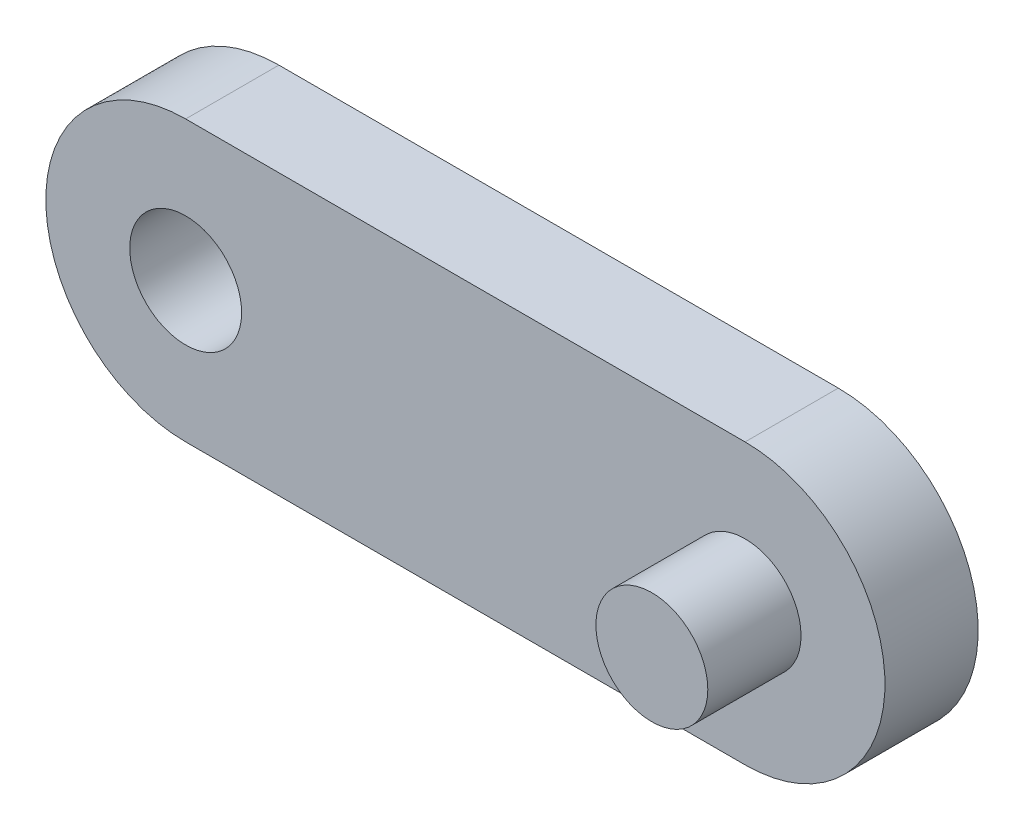
ISO-10303-21;
HEADER;
FILE_DESCRIPTION(('STEP AP214'),'2;1');
FILE_NAME('part.step','',(''),(''),'','','');
FILE_SCHEMA(('AUTOMOTIVE_DESIGN { 1 0 10303 214 1 1 1 1 }'));
ENDSEC;
DATA;
#1=APPLICATION_CONTEXT('core data for automotive mechanical design processes');
#2=APPLICATION_PROTOCOL_DEFINITION('international standard','automotive_design',2000,#1);
#3=PRODUCT_CONTEXT('',#1,'mechanical');
#4=PRODUCT('Part','Part','',(#3));
#5=PRODUCT_RELATED_PRODUCT_CATEGORY('part','',(#4));
#6=PRODUCT_DEFINITION_FORMATION('','',#4);
#7=PRODUCT_DEFINITION_CONTEXT('part definition',#1,'design');
#8=PRODUCT_DEFINITION('design','',#6,#7);
#9=PRODUCT_DEFINITION_SHAPE('','',#8);
#10=(LENGTH_UNIT() NAMED_UNIT(*) SI_UNIT(.MILLI.,.METRE.));
#11=(NAMED_UNIT(*) PLANE_ANGLE_UNIT() SI_UNIT($,.RADIAN.));
#12=(NAMED_UNIT(*) SI_UNIT($,.STERADIAN.) SOLID_ANGLE_UNIT());
#13=UNCERTAINTY_MEASURE_WITH_UNIT(LENGTH_MEASURE(1.E-05),#10,'distance_accuracy_value','');
#14=(GEOMETRIC_REPRESENTATION_CONTEXT(3) GLOBAL_UNCERTAINTY_ASSIGNED_CONTEXT((#13)) GLOBAL_UNIT_ASSIGNED_CONTEXT((#10,
#11,#12)) REPRESENTATION_CONTEXT('',''));
#15=CARTESIAN_POINT('',(0.,0.,0.));
#16=DIRECTION('',(0.,0.,1.));
#17=DIRECTION('',(1.,0.,0.));
#18=AXIS2_PLACEMENT_3D('',#15,#16,#17);
#19=CARTESIAN_POINT('',(0.,0.,10.));
#20=DIRECTION('',(0.,0.,1.));
#21=DIRECTION('',(1.,0.,0.));
#22=AXIS2_PLACEMENT_3D('',#19,#20,#21);
#23=PLANE('',#22);
#24=CARTESIAN_POINT('',(60.,0.,10.));
#25=DIRECTION('',(0.,0.,1.));
#26=DIRECTION('',(1.,0.,0.));
#27=AXIS2_PLACEMENT_3D('',#24,#25,#26);
#28=CIRCLE('',#27,6.00000000000002);
#29=CARTESIAN_POINT('',(66.,0.,10.));
#30=VERTEX_POINT('',#29);
#31=EDGE_CURVE('E118',#30,#30,#28,.T.);
#32=ORIENTED_EDGE('',*,*,#31,.F.);
#33=EDGE_LOOP('',(#32));
#34=FACE_BOUND('',#33,.T.);
#35=CARTESIAN_POINT('',(0.,0.,10.));
#36=DIRECTION('',(0.,0.,1.));
#37=DIRECTION('',(1.,0.,0.));
#38=AXIS2_PLACEMENT_3D('',#35,#36,#37);
#39=CIRCLE('',#38,15.);
#40=CARTESIAN_POINT('',(0.,15.,10.));
#41=VERTEX_POINT('',#40);
#42=CARTESIAN_POINT('',(0.,-15.,10.));
#43=VERTEX_POINT('',#42);
#44=EDGE_CURVE('E85',#41,#43,#39,.T.);
#45=ORIENTED_EDGE('',*,*,#44,.T.);
#46=DIRECTION('',(1.,0.,0.));
#47=VECTOR('',#46,1.);
#48=CARTESIAN_POINT('',(0.,-15.,10.));
#49=LINE('',#48,#47);
#50=CARTESIAN_POINT('',(60.,-15.,10.));
#51=VERTEX_POINT('',#50);
#52=EDGE_CURVE('E80',#43,#51,#49,.T.);
#53=ORIENTED_EDGE('',*,*,#52,.T.);
#54=CARTESIAN_POINT('',(60.,0.,10.));
#55=DIRECTION('',(0.,0.,1.));
#56=DIRECTION('',(1.,0.,0.));
#57=AXIS2_PLACEMENT_3D('',#54,#55,#56);
#58=CIRCLE('',#57,15.);
#59=CARTESIAN_POINT('',(60.,15.,10.));
#60=VERTEX_POINT('',#59);
#61=EDGE_CURVE('E83',#51,#60,#58,.T.);
#62=ORIENTED_EDGE('',*,*,#61,.T.);
#63=DIRECTION('',(-1.,0.,0.));
#64=VECTOR('',#63,1.);
#65=CARTESIAN_POINT('',(0.,15.,10.));
#66=LINE('',#65,#64);
#67=EDGE_CURVE('E50',#60,#41,#66,.T.);
#68=ORIENTED_EDGE('',*,*,#67,.T.);
#69=EDGE_LOOP('',(#45,#53,#62,#68));
#70=FACE_BOUND('',#69,.T.);
#71=CARTESIAN_POINT('',(0.,0.,10.));
#72=DIRECTION('',(0.,0.,1.));
#73=DIRECTION('',(1.,0.,0.));
#74=AXIS2_PLACEMENT_3D('',#71,#72,#73);
#75=CIRCLE('',#74,6.);
#76=CARTESIAN_POINT('',(6.,0.,10.));
#77=VERTEX_POINT('',#76);
#78=EDGE_CURVE('E100',#77,#77,#75,.T.);
#79=ORIENTED_EDGE('',*,*,#78,.F.);
#80=EDGE_LOOP('',(#79));
#81=FACE_BOUND('',#80,.T.);
#82=ADVANCED_FACE('F33',(#34,#70,#81),#23,.T.);
#83=CARTESIAN_POINT('',(0.,0.,0.));
#84=DIRECTION('',(0.,0.,1.));
#85=DIRECTION('',(1.,0.,0.));
#86=AXIS2_PLACEMENT_3D('',#83,#84,#85);
#87=PLANE('',#86);
#88=CARTESIAN_POINT('',(0.,0.,0.));
#89=DIRECTION('',(0.,0.,1.));
#90=DIRECTION('',(1.,0.,0.));
#91=AXIS2_PLACEMENT_3D('',#88,#89,#90);
#92=CIRCLE('',#91,15.);
#93=CARTESIAN_POINT('',(0.,15.,0.));
#94=VERTEX_POINT('',#93);
#95=CARTESIAN_POINT('',(0.,-15.,0.));
#96=VERTEX_POINT('',#95);
#97=EDGE_CURVE('E97',#94,#96,#92,.T.);
#98=ORIENTED_EDGE('',*,*,#97,.F.);
#99=DIRECTION('',(-1.,0.,0.));
#100=VECTOR('',#99,1.);
#101=CARTESIAN_POINT('',(0.,15.,0.));
#102=LINE('',#101,#100);
#103=CARTESIAN_POINT('',(60.,15.,0.));
#104=VERTEX_POINT('',#103);
#105=EDGE_CURVE('E73',#104,#94,#102,.T.);
#106=ORIENTED_EDGE('',*,*,#105,.F.);
#107=CARTESIAN_POINT('',(60.,0.,0.));
#108=DIRECTION('',(0.,0.,1.));
#109=DIRECTION('',(1.,0.,0.));
#110=AXIS2_PLACEMENT_3D('',#107,#108,#109);
#111=CIRCLE('',#110,15.);
#112=CARTESIAN_POINT('',(60.,-15.,0.));
#113=VERTEX_POINT('',#112);
#114=EDGE_CURVE('E67',#113,#104,#111,.T.);
#115=ORIENTED_EDGE('',*,*,#114,.F.);
#116=DIRECTION('',(1.,0.,0.));
#117=VECTOR('',#116,1.);
#118=CARTESIAN_POINT('',(0.,-15.,0.));
#119=LINE('',#118,#117);
#120=EDGE_CURVE('E89',#96,#113,#119,.T.);
#121=ORIENTED_EDGE('',*,*,#120,.F.);
#122=EDGE_LOOP('',(#98,#106,#115,#121));
#123=FACE_BOUND('',#122,.T.);
#124=CARTESIAN_POINT('',(0.,0.,0.));
#125=DIRECTION('',(0.,0.,1.));
#126=DIRECTION('',(1.,0.,0.));
#127=AXIS2_PLACEMENT_3D('',#124,#125,#126);
#128=CIRCLE('',#127,6.);
#129=CARTESIAN_POINT('',(6.,0.,0.));
#130=VERTEX_POINT('',#129);
#131=EDGE_CURVE('E112',#130,#130,#128,.T.);
#132=ORIENTED_EDGE('',*,*,#131,.T.);
#133=EDGE_LOOP('',(#132));
#134=FACE_BOUND('',#133,.T.);
#135=ADVANCED_FACE('F108',(#123,#134),#87,.F.);
#136=CARTESIAN_POINT('',(0.,0.,10.));
#137=DIRECTION('',(0.,0.,-1.));
#138=DIRECTION('',(-1.,0.,0.));
#139=AXIS2_PLACEMENT_3D('',#136,#137,#138);
#140=CYLINDRICAL_SURFACE('',#139,15.);
#141=ORIENTED_EDGE('',*,*,#97,.T.);
#142=DIRECTION('',(0.,0.,-1.));
#143=VECTOR('',#142,1.);
#144=CARTESIAN_POINT('',(0.,-15.,10.));
#145=LINE('',#144,#143);
#146=EDGE_CURVE('E11',#43,#96,#145,.T.);
#147=ORIENTED_EDGE('',*,*,#146,.F.);
#148=ORIENTED_EDGE('',*,*,#44,.F.);
#149=DIRECTION('',(0.,0.,-1.));
#150=VECTOR('',#149,1.);
#151=CARTESIAN_POINT('',(0.,15.,10.));
#152=LINE('',#151,#150);
#153=EDGE_CURVE('E93',#41,#94,#152,.T.);
#154=ORIENTED_EDGE('',*,*,#153,.T.);
#155=EDGE_LOOP('',(#141,#147,#148,#154));
#156=FACE_BOUND('',#155,.T.);
#157=ADVANCED_FACE('F35',(#156),#140,.T.);
#158=CARTESIAN_POINT('',(0.,-15.,10.));
#159=DIRECTION('',(0.,1.,0.));
#160=DIRECTION('',(-1.,0.,0.));
#161=AXIS2_PLACEMENT_3D('',#158,#159,#160);
#162=PLANE('',#161);
#163=ORIENTED_EDGE('',*,*,#120,.T.);
#164=DIRECTION('',(0.,0.,-1.));
#165=VECTOR('',#164,1.);
#166=CARTESIAN_POINT('',(60.,-15.,10.));
#167=LINE('',#166,#165);
#168=EDGE_CURVE('E42',#51,#113,#167,.T.);
#169=ORIENTED_EDGE('',*,*,#168,.F.);
#170=ORIENTED_EDGE('',*,*,#52,.F.);
#171=ORIENTED_EDGE('',*,*,#146,.T.);
#172=EDGE_LOOP('',(#163,#169,#170,#171));
#173=FACE_BOUND('',#172,.T.);
#174=ADVANCED_FACE('F88',(#173),#162,.F.);
#175=CARTESIAN_POINT('',(60.,0.,10.));
#176=DIRECTION('',(0.,0.,-1.));
#177=DIRECTION('',(-1.,0.,0.));
#178=AXIS2_PLACEMENT_3D('',#175,#176,#177);
#179=CYLINDRICAL_SURFACE('',#178,15.);
#180=ORIENTED_EDGE('',*,*,#114,.T.);
#181=DIRECTION('',(0.,0.,-1.));
#182=VECTOR('',#181,1.);
#183=CARTESIAN_POINT('',(60.,15.,10.));
#184=LINE('',#183,#182);
#185=EDGE_CURVE('E90',#60,#104,#184,.T.);
#186=ORIENTED_EDGE('',*,*,#185,.F.);
#187=ORIENTED_EDGE('',*,*,#61,.F.);
#188=ORIENTED_EDGE('',*,*,#168,.T.);
#189=EDGE_LOOP('',(#180,#186,#187,#188));
#190=FACE_BOUND('',#189,.T.);
#191=ADVANCED_FACE('F91',(#190),#179,.T.);
#192=CARTESIAN_POINT('',(0.,15.,10.));
#193=DIRECTION('',(0.,-1.,0.));
#194=DIRECTION('',(1.,0.,0.));
#195=AXIS2_PLACEMENT_3D('',#192,#193,#194);
#196=PLANE('',#195);
#197=ORIENTED_EDGE('',*,*,#105,.T.);
#198=ORIENTED_EDGE('',*,*,#153,.F.);
#199=ORIENTED_EDGE('',*,*,#67,.F.);
#200=ORIENTED_EDGE('',*,*,#185,.T.);
#201=EDGE_LOOP('',(#197,#198,#199,#200));
#202=FACE_BOUND('',#201,.T.);
#203=ADVANCED_FACE('F105',(#202),#196,.F.);
#204=CARTESIAN_POINT('',(0.,0.,10.));
#205=DIRECTION('',(0.,0.,-1.));
#206=DIRECTION('',(-1.,0.,0.));
#207=AXIS2_PLACEMENT_3D('',#204,#205,#206);
#208=CYLINDRICAL_SURFACE('',#207,6.);
#209=ORIENTED_EDGE('',*,*,#78,.T.);
#210=EDGE_LOOP('',(#209));
#211=FACE_BOUND('',#210,.T.);
#212=ORIENTED_EDGE('',*,*,#131,.F.);
#213=EDGE_LOOP('',(#212));
#214=FACE_BOUND('',#213,.T.);
#215=ADVANCED_FACE('F129',(#211,#214),#208,.F.);
#216=CARTESIAN_POINT('',(60.,0.,20.));
#217=DIRECTION('',(0.,0.,-1.));
#218=DIRECTION('',(-1.,0.,0.));
#219=AXIS2_PLACEMENT_3D('',#216,#217,#218);
#220=CYLINDRICAL_SURFACE('',#219,6.00000000000002);
#221=CARTESIAN_POINT('',(60.,0.,20.));
#222=DIRECTION('',(0.,0.,1.));
#223=DIRECTION('',(1.,0.,0.));
#224=AXIS2_PLACEMENT_3D('',#221,#222,#223);
#225=CIRCLE('',#224,6.00000000000002);
#226=CARTESIAN_POINT('',(66.,0.,20.));
#227=VERTEX_POINT('',#226);
#228=EDGE_CURVE('E115',#227,#227,#225,.T.);
#229=ORIENTED_EDGE('',*,*,#228,.F.);
#230=EDGE_LOOP('',(#229));
#231=FACE_BOUND('',#230,.T.);
#232=ORIENTED_EDGE('',*,*,#31,.T.);
#233=EDGE_LOOP('',(#232));
#234=FACE_BOUND('',#233,.T.);
#235=ADVANCED_FACE('F126',(#231,#234),#220,.T.);
#236=CARTESIAN_POINT('',(60.,0.,20.));
#237=DIRECTION('',(0.,0.,1.));
#238=DIRECTION('',(1.,0.,0.));
#239=AXIS2_PLACEMENT_3D('',#236,#237,#238);
#240=PLANE('',#239);
#241=ORIENTED_EDGE('',*,*,#228,.T.);
#242=EDGE_LOOP('',(#241));
#243=FACE_BOUND('',#242,.T.);
#244=ADVANCED_FACE('F124',(#243),#240,.T.);
#245=CLOSED_SHELL('',(#82,#135,#157,#174,#191,#203,#215,#235,#244));
#246=MANIFOLD_SOLID_BREP('B2',#245);
#247=ADVANCED_BREP_SHAPE_REPRESENTATION('',(#18,#246),#14);
#248=SHAPE_DEFINITION_REPRESENTATION(#9,#247);
ENDSEC;
END-ISO-10303-21;
